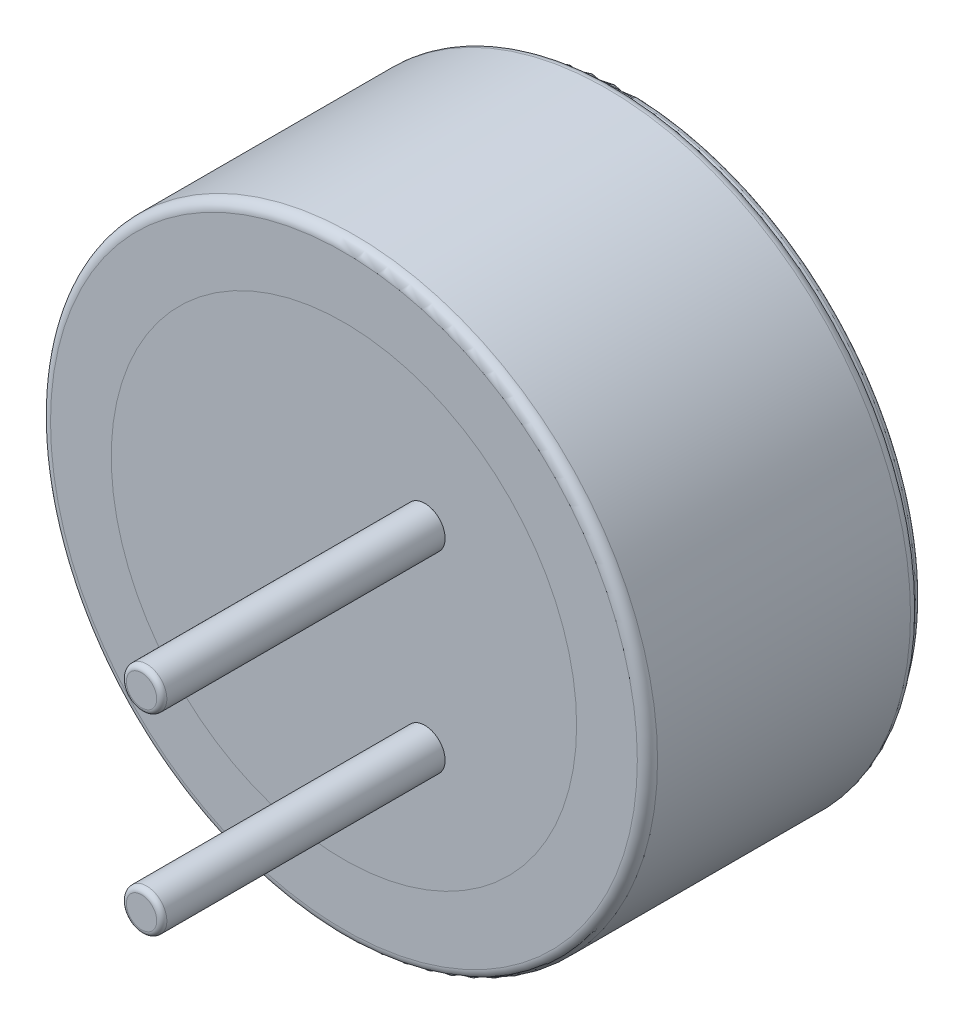
ISO-10303-21;
HEADER;
FILE_DESCRIPTION(('STEP AP214'),'2;1');
FILE_NAME('part.step','',(''),(''),'','','');
FILE_SCHEMA(('AUTOMOTIVE_DESIGN { 1 0 10303 214 1 1 1 1 }'));
ENDSEC;
DATA;
#1=APPLICATION_CONTEXT('core data for automotive mechanical design processes');
#2=APPLICATION_PROTOCOL_DEFINITION('international standard','automotive_design',2000,#1);
#3=PRODUCT_CONTEXT('',#1,'mechanical');
#4=PRODUCT('Part','Part','',(#3));
#5=PRODUCT_RELATED_PRODUCT_CATEGORY('part','',(#4));
#6=PRODUCT_DEFINITION_FORMATION('','',#4);
#7=PRODUCT_DEFINITION_CONTEXT('part definition',#1,'design');
#8=PRODUCT_DEFINITION('design','',#6,#7);
#9=PRODUCT_DEFINITION_SHAPE('','',#8);
#10=(LENGTH_UNIT() NAMED_UNIT(*) SI_UNIT(.MILLI.,.METRE.));
#11=(NAMED_UNIT(*) PLANE_ANGLE_UNIT() SI_UNIT($,.RADIAN.));
#12=(NAMED_UNIT(*) SI_UNIT($,.STERADIAN.) SOLID_ANGLE_UNIT());
#13=UNCERTAINTY_MEASURE_WITH_UNIT(LENGTH_MEASURE(1.E-05),#10,'distance_accuracy_value','');
#14=(GEOMETRIC_REPRESENTATION_CONTEXT(3) GLOBAL_UNCERTAINTY_ASSIGNED_CONTEXT((#13)) GLOBAL_UNIT_ASSIGNED_CONTEXT((#10,
#11,#12)) REPRESENTATION_CONTEXT('',''));
#15=CARTESIAN_POINT('',(0.,0.,0.));
#16=DIRECTION('',(0.,0.,1.));
#17=DIRECTION('',(1.,0.,0.));
#18=AXIS2_PLACEMENT_3D('',#15,#16,#17);
#19=CARTESIAN_POINT('',(0.,0.,2.7));
#20=DIRECTION('',(0.,0.,-1.));
#21=DIRECTION('',(-1.,0.,0.));
#22=AXIS2_PLACEMENT_3D('',#19,#20,#21);
#23=CYLINDRICAL_SURFACE('',#22,2.3);
#24=CARTESIAN_POINT('',(0.,0.,2.7));
#25=DIRECTION('',(0.,0.,1.));
#26=DIRECTION('',(1.,0.,0.));
#27=AXIS2_PLACEMENT_3D('',#24,#25,#26);
#28=CIRCLE('',#27,2.3);
#29=CARTESIAN_POINT('',(2.3,0.,2.7));
#30=VERTEX_POINT('',#29);
#31=EDGE_CURVE('E11',#30,#30,#28,.T.);
#32=ORIENTED_EDGE('',*,*,#31,.F.);
#33=EDGE_LOOP('',(#32));
#34=FACE_BOUND('',#33,.T.);
#35=CARTESIAN_POINT('',(0.,0.,2.6));
#36=DIRECTION('',(0.,0.,1.));
#37=DIRECTION('',(1.,0.,0.));
#38=AXIS2_PLACEMENT_3D('',#35,#36,#37);
#39=CIRCLE('',#38,2.3);
#40=CARTESIAN_POINT('',(2.3,0.,2.6));
#41=VERTEX_POINT('',#40);
#42=EDGE_CURVE('E45',#41,#41,#39,.T.);
#43=ORIENTED_EDGE('',*,*,#42,.T.);
#44=EDGE_LOOP('',(#43));
#45=FACE_BOUND('',#44,.T.);
#46=ADVANCED_FACE('F42',(#34,#45),#23,.T.);
#47=CARTESIAN_POINT('',(0.,0.,2.7));
#48=DIRECTION('',(0.,0.,1.));
#49=DIRECTION('',(1.,0.,0.));
#50=AXIS2_PLACEMENT_3D('',#47,#48,#49);
#51=PLANE('',#50);
#52=ORIENTED_EDGE('',*,*,#31,.T.);
#53=EDGE_LOOP('',(#52));
#54=FACE_BOUND('',#53,.T.);
#55=ADVANCED_FACE('F57',(#54),#51,.T.);
#56=CARTESIAN_POINT('',(0.,0.,2.6));
#57=DIRECTION('',(0.,0.,1.));
#58=DIRECTION('',(1.,0.,0.));
#59=AXIS2_PLACEMENT_3D('',#56,#57,#58);
#60=PLANE('',#59);
#61=ORIENTED_EDGE('',*,*,#42,.F.);
#62=EDGE_LOOP('',(#61));
#63=FACE_BOUND('',#62,.T.);
#64=ADVANCED_FACE('F55',(#63),#60,.F.);
#65=CLOSED_SHELL('',(#46,#55,#64));
#66=MANIFOLD_SOLID_BREP('B2',#65);
#67=CARTESIAN_POINT('',(0.,0.,-0.1));
#68=DIRECTION('',(0.,0.,1.));
#69=DIRECTION('',(1.,0.,0.));
#70=AXIS2_PLACEMENT_3D('',#67,#68,#69);
#71=CYLINDRICAL_SURFACE('',#70,2.9);
#72=CARTESIAN_POINT('',(0.,0.,-0.05));
#73=DIRECTION('',(0.,0.,-1.));
#74=DIRECTION('',(-1.,0.,0.));
#75=AXIS2_PLACEMENT_3D('',#72,#73,#74);
#76=CIRCLE('',#75,2.9);
#77=CARTESIAN_POINT('',(-2.9,0.,-0.05));
#78=VERTEX_POINT('',#77);
#79=EDGE_CURVE('E41',#78,#78,#76,.F.);
#80=ORIENTED_EDGE('',*,*,#79,.T.);
#81=EDGE_LOOP('',(#80));
#82=FACE_BOUND('',#81,.T.);
#83=CARTESIAN_POINT('',(0.,0.,0.));
#84=DIRECTION('',(0.,0.,-1.));
#85=DIRECTION('',(-1.,0.,0.));
#86=AXIS2_PLACEMENT_3D('',#83,#84,#85);
#87=CIRCLE('',#86,2.9);
#88=CARTESIAN_POINT('',(-2.9,0.,0.));
#89=VERTEX_POINT('',#88);
#90=EDGE_CURVE('E102',#89,#89,#87,.T.);
#91=ORIENTED_EDGE('',*,*,#90,.T.);
#92=EDGE_LOOP('',(#91));
#93=FACE_BOUND('',#92,.T.);
#94=ADVANCED_FACE('F91',(#82,#93),#71,.T.);
#95=CARTESIAN_POINT('',(0.,0.,-0.1));
#96=DIRECTION('',(0.,0.,-1.));
#97=DIRECTION('',(-1.,0.,0.));
#98=AXIS2_PLACEMENT_3D('',#95,#96,#97);
#99=PLANE('',#98);
#100=CARTESIAN_POINT('',(0.,0.,-0.1));
#101=DIRECTION('',(0.,0.,-1.));
#102=DIRECTION('',(-1.,0.,0.));
#103=AXIS2_PLACEMENT_3D('',#100,#101,#102);
#104=CIRCLE('',#103,2.85);
#105=CARTESIAN_POINT('',(-2.85,0.,-0.1));
#106=VERTEX_POINT('',#105);
#107=EDGE_CURVE('E98',#106,#106,#104,.T.);
#108=ORIENTED_EDGE('',*,*,#107,.T.);
#109=EDGE_LOOP('',(#108));
#110=FACE_BOUND('',#109,.T.);
#111=ADVANCED_FACE('F112',(#110),#99,.T.);
#112=CARTESIAN_POINT('',(0.,0.,0.));
#113=DIRECTION('',(0.,0.,-1.));
#114=DIRECTION('',(-1.,0.,0.));
#115=AXIS2_PLACEMENT_3D('',#112,#113,#114);
#116=PLANE('',#115);
#117=ORIENTED_EDGE('',*,*,#90,.F.);
#118=EDGE_LOOP('',(#117));
#119=FACE_BOUND('',#118,.T.);
#120=ADVANCED_FACE('F110',(#119),#116,.F.);
#121=CARTESIAN_POINT('',(0.,0.,-0.05));
#122=DIRECTION('',(0.,0.,-1.));
#123=DIRECTION('',(-1.,0.,0.));
#124=AXIS2_PLACEMENT_3D('',#121,#122,#123);
#125=TOROIDAL_SURFACE('',#124,2.85,0.05);
#126=ORIENTED_EDGE('',*,*,#79,.F.);
#127=EDGE_LOOP('',(#126));
#128=FACE_BOUND('',#127,.T.);
#129=ORIENTED_EDGE('',*,*,#107,.F.);
#130=EDGE_LOOP('',(#129));
#131=FACE_BOUND('',#130,.T.);
#132=ADVANCED_FACE('F93',(#128,#131),#125,.T.);
#133=CLOSED_SHELL('',(#94,#111,#120,#132));
#134=MANIFOLD_SOLID_BREP('B6',#133);
#135=CARTESIAN_POINT('',(0.800000000000001,0.95,5.5));
#136=DIRECTION('',(0.,0.,-1.));
#137=DIRECTION('',(-1.,0.,0.));
#138=AXIS2_PLACEMENT_3D('',#135,#136,#137);
#139=CYLINDRICAL_SURFACE('',#138,0.2);
#140=CARTESIAN_POINT('',(0.800000000000001,0.95,5.45));
#141=DIRECTION('',(0.,0.,-1.));
#142=DIRECTION('',(-1.,0.,0.));
#143=AXIS2_PLACEMENT_3D('',#140,#141,#142);
#144=CIRCLE('',#143,0.2);
#145=CARTESIAN_POINT('',(0.600000000000001,0.95,5.45));
#146=VERTEX_POINT('',#145);
#147=EDGE_CURVE('E90',#146,#146,#144,.T.);
#148=ORIENTED_EDGE('',*,*,#147,.T.);
#149=EDGE_LOOP('',(#148));
#150=FACE_BOUND('',#149,.T.);
#151=CARTESIAN_POINT('',(0.800000000000001,0.95,2.7));
#152=DIRECTION('',(0.,0.,1.));
#153=DIRECTION('',(-1.,0.,0.));
#154=AXIS2_PLACEMENT_3D('',#151,#152,#153);
#155=CIRCLE('',#154,0.2);
#156=CARTESIAN_POINT('',(0.600000000000001,0.95,2.7));
#157=VERTEX_POINT('',#156);
#158=EDGE_CURVE('E166',#157,#157,#155,.T.);
#159=ORIENTED_EDGE('',*,*,#158,.T.);
#160=EDGE_LOOP('',(#159));
#161=FACE_BOUND('',#160,.T.);
#162=ADVANCED_FACE('F155',(#150,#161),#139,.T.);
#163=CARTESIAN_POINT('',(0.800000000000001,0.95,5.5));
#164=DIRECTION('',(0.,0.,-1.));
#165=DIRECTION('',(-1.,0.,0.));
#166=AXIS2_PLACEMENT_3D('',#163,#164,#165);
#167=PLANE('',#166);
#168=CARTESIAN_POINT('',(0.800000000000001,0.95,5.5));
#169=DIRECTION('',(0.,0.,-1.));
#170=DIRECTION('',(-1.,0.,0.));
#171=AXIS2_PLACEMENT_3D('',#168,#169,#170);
#172=CIRCLE('',#171,0.15);
#173=CARTESIAN_POINT('',(0.650000000000001,0.95,5.5));
#174=VERTEX_POINT('',#173);
#175=EDGE_CURVE('E162',#174,#174,#172,.F.);
#176=ORIENTED_EDGE('',*,*,#175,.T.);
#177=EDGE_LOOP('',(#176));
#178=FACE_BOUND('',#177,.T.);
#179=ADVANCED_FACE('F176',(#178),#167,.F.);
#180=CARTESIAN_POINT('',(0.800000000000001,0.95,2.7));
#181=DIRECTION('',(0.,0.,-1.));
#182=DIRECTION('',(-1.,0.,0.));
#183=AXIS2_PLACEMENT_3D('',#180,#181,#182);
#184=PLANE('',#183);
#185=ORIENTED_EDGE('',*,*,#158,.F.);
#186=EDGE_LOOP('',(#185));
#187=FACE_BOUND('',#186,.T.);
#188=ADVANCED_FACE('F174',(#187),#184,.T.);
#189=CARTESIAN_POINT('',(0.800000000000001,0.95,5.45));
#190=DIRECTION('',(0.,0.,-1.));
#191=DIRECTION('',(-1.,0.,0.));
#192=AXIS2_PLACEMENT_3D('',#189,#190,#191);
#193=TOROIDAL_SURFACE('',#192,0.15,0.05);
#194=ORIENTED_EDGE('',*,*,#147,.F.);
#195=EDGE_LOOP('',(#194));
#196=FACE_BOUND('',#195,.T.);
#197=ORIENTED_EDGE('',*,*,#175,.F.);
#198=EDGE_LOOP('',(#197));
#199=FACE_BOUND('',#198,.T.);
#200=ADVANCED_FACE('F157',(#196,#199),#193,.T.);
#201=CLOSED_SHELL('',(#162,#179,#188,#200));
#202=MANIFOLD_SOLID_BREP('B36',#201);
#203=CARTESIAN_POINT('',(0.800000000000001,-0.95,5.5));
#204=DIRECTION('',(0.,0.,-1.));
#205=DIRECTION('',(-1.,0.,0.));
#206=AXIS2_PLACEMENT_3D('',#203,#204,#205);
#207=CYLINDRICAL_SURFACE('',#206,0.2);
#208=CARTESIAN_POINT('',(0.800000000000001,-0.95,5.45));
#209=DIRECTION('',(0.,0.,1.));
#210=DIRECTION('',(1.,0.,0.));
#211=AXIS2_PLACEMENT_3D('',#208,#209,#210);
#212=CIRCLE('',#211,0.2);
#213=CARTESIAN_POINT('',(1.,-0.95,5.45));
#214=VERTEX_POINT('',#213);
#215=EDGE_CURVE('E154',#214,#214,#212,.F.);
#216=ORIENTED_EDGE('',*,*,#215,.T.);
#217=EDGE_LOOP('',(#216));
#218=FACE_BOUND('',#217,.T.);
#219=CARTESIAN_POINT('',(0.800000000000001,-0.95,2.7));
#220=DIRECTION('',(0.,0.,1.));
#221=DIRECTION('',(1.,0.,0.));
#222=AXIS2_PLACEMENT_3D('',#219,#220,#221);
#223=CIRCLE('',#222,0.2);
#224=CARTESIAN_POINT('',(1.,-0.95,2.7));
#225=VERTEX_POINT('',#224);
#226=EDGE_CURVE('E229',#225,#225,#223,.T.);
#227=ORIENTED_EDGE('',*,*,#226,.T.);
#228=EDGE_LOOP('',(#227));
#229=FACE_BOUND('',#228,.T.);
#230=ADVANCED_FACE('F218',(#218,#229),#207,.T.);
#231=CARTESIAN_POINT('',(0.800000000000001,-0.95,5.5));
#232=DIRECTION('',(0.,0.,1.));
#233=DIRECTION('',(1.,0.,0.));
#234=AXIS2_PLACEMENT_3D('',#231,#232,#233);
#235=PLANE('',#234);
#236=CARTESIAN_POINT('',(0.800000000000001,-0.95,5.5));
#237=DIRECTION('',(0.,0.,1.));
#238=DIRECTION('',(1.,0.,0.));
#239=AXIS2_PLACEMENT_3D('',#236,#237,#238);
#240=CIRCLE('',#239,0.15);
#241=CARTESIAN_POINT('',(0.950000000000001,-0.95,5.5));
#242=VERTEX_POINT('',#241);
#243=EDGE_CURVE('E225',#242,#242,#240,.T.);
#244=ORIENTED_EDGE('',*,*,#243,.T.);
#245=EDGE_LOOP('',(#244));
#246=FACE_BOUND('',#245,.T.);
#247=ADVANCED_FACE('F239',(#246),#235,.T.);
#248=CARTESIAN_POINT('',(0.800000000000001,-0.95,2.7));
#249=DIRECTION('',(0.,0.,1.));
#250=DIRECTION('',(1.,0.,0.));
#251=AXIS2_PLACEMENT_3D('',#248,#249,#250);
#252=PLANE('',#251);
#253=ORIENTED_EDGE('',*,*,#226,.F.);
#254=EDGE_LOOP('',(#253));
#255=FACE_BOUND('',#254,.T.);
#256=ADVANCED_FACE('F237',(#255),#252,.F.);
#257=CARTESIAN_POINT('',(0.800000000000001,-0.95,5.45));
#258=DIRECTION('',(0.,0.,1.));
#259=DIRECTION('',(1.,0.,0.));
#260=AXIS2_PLACEMENT_3D('',#257,#258,#259);
#261=TOROIDAL_SURFACE('',#260,0.15,0.05);
#262=ORIENTED_EDGE('',*,*,#215,.F.);
#263=EDGE_LOOP('',(#262));
#264=FACE_BOUND('',#263,.T.);
#265=ORIENTED_EDGE('',*,*,#243,.F.);
#266=EDGE_LOOP('',(#265));
#267=FACE_BOUND('',#266,.T.);
#268=ADVANCED_FACE('F220',(#264,#267),#261,.T.);
#269=CLOSED_SHELL('',(#230,#247,#256,#268));
#270=MANIFOLD_SOLID_BREP('B85',#269);
#271=CARTESIAN_POINT('',(0.,0.,2.7));
#272=DIRECTION('',(0.,0.,-1.));
#273=DIRECTION('',(-1.,0.,0.));
#274=AXIS2_PLACEMENT_3D('',#271,#272,#273);
#275=CYLINDRICAL_SURFACE('',#274,3.);
#276=CARTESIAN_POINT('',(0.,0.,2.6));
#277=DIRECTION('',(0.,0.,1.));
#278=DIRECTION('',(1.,0.,0.));
#279=AXIS2_PLACEMENT_3D('',#276,#277,#278);
#280=CIRCLE('',#279,3.);
#281=CARTESIAN_POINT('',(3.,0.,2.6));
#282=VERTEX_POINT('',#281);
#283=EDGE_CURVE('E281',#282,#282,#280,.F.);
#284=ORIENTED_EDGE('',*,*,#283,.T.);
#285=EDGE_LOOP('',(#284));
#286=FACE_BOUND('',#285,.T.);
#287=CARTESIAN_POINT('',(0.,0.,0.0999999999999998));
#288=DIRECTION('',(0.,0.,1.));
#289=DIRECTION('',(1.,0.,0.));
#290=AXIS2_PLACEMENT_3D('',#287,#288,#289);
#291=CIRCLE('',#290,3.);
#292=CARTESIAN_POINT('',(3.,0.,0.0999999999999998));
#293=VERTEX_POINT('',#292);
#294=EDGE_CURVE('E285',#293,#293,#291,.T.);
#295=ORIENTED_EDGE('',*,*,#294,.T.);
#296=EDGE_LOOP('',(#295));
#297=FACE_BOUND('',#296,.T.);
#298=ADVANCED_FACE('F274',(#286,#297),#275,.T.);
#299=CARTESIAN_POINT('',(0.,0.,2.7));
#300=DIRECTION('',(0.,0.,1.));
#301=DIRECTION('',(1.,0.,0.));
#302=AXIS2_PLACEMENT_3D('',#299,#300,#301);
#303=PLANE('',#302);
#304=CARTESIAN_POINT('',(0.,0.,2.7));
#305=DIRECTION('',(0.,0.,1.));
#306=DIRECTION('',(1.,0.,0.));
#307=AXIS2_PLACEMENT_3D('',#304,#305,#306);
#308=CIRCLE('',#307,2.3);
#309=CARTESIAN_POINT('',(2.3,0.,2.7));
#310=VERTEX_POINT('',#309);
#311=EDGE_CURVE('E295',#310,#310,#308,.T.);
#312=ORIENTED_EDGE('',*,*,#311,.F.);
#313=EDGE_LOOP('',(#312));
#314=FACE_BOUND('',#313,.T.);
#315=CARTESIAN_POINT('',(0.,0.,2.7));
#316=DIRECTION('',(0.,0.,1.));
#317=DIRECTION('',(1.,0.,0.));
#318=AXIS2_PLACEMENT_3D('',#315,#316,#317);
#319=CIRCLE('',#318,2.9);
#320=CARTESIAN_POINT('',(2.9,0.,2.7));
#321=VERTEX_POINT('',#320);
#322=EDGE_CURVE('E289',#321,#321,#319,.T.);
#323=ORIENTED_EDGE('',*,*,#322,.T.);
#324=EDGE_LOOP('',(#323));
#325=FACE_BOUND('',#324,.T.);
#326=ADVANCED_FACE('F309',(#314,#325),#303,.T.);
#327=CARTESIAN_POINT('',(0.,0.,0.));
#328=DIRECTION('',(0.,0.,1.));
#329=DIRECTION('',(1.,0.,0.));
#330=AXIS2_PLACEMENT_3D('',#327,#328,#329);
#331=PLANE('',#330);
#332=CARTESIAN_POINT('',(0.,0.,0.));
#333=DIRECTION('',(0.,0.,1.));
#334=DIRECTION('',(1.,0.,0.));
#335=AXIS2_PLACEMENT_3D('',#332,#333,#334);
#336=CIRCLE('',#335,2.9);
#337=CARTESIAN_POINT('',(2.9,0.,0.));
#338=VERTEX_POINT('',#337);
#339=EDGE_CURVE('E217',#338,#338,#336,.F.);
#340=ORIENTED_EDGE('',*,*,#339,.T.);
#341=EDGE_LOOP('',(#340));
#342=FACE_BOUND('',#341,.T.);
#343=ADVANCED_FACE('F312',(#342),#331,.F.);
#344=CARTESIAN_POINT('',(0.,0.,2.6));
#345=DIRECTION('',(0.,0.,1.));
#346=DIRECTION('',(1.,0.,0.));
#347=AXIS2_PLACEMENT_3D('',#344,#345,#346);
#348=TOROIDAL_SURFACE('',#347,2.9,0.1);
#349=ORIENTED_EDGE('',*,*,#283,.F.);
#350=EDGE_LOOP('',(#349));
#351=FACE_BOUND('',#350,.T.);
#352=ORIENTED_EDGE('',*,*,#322,.F.);
#353=EDGE_LOOP('',(#352));
#354=FACE_BOUND('',#353,.T.);
#355=ADVANCED_FACE('F316',(#351,#354),#348,.T.);
#356=CARTESIAN_POINT('',(0.,0.,0.0999999999999998));
#357=DIRECTION('',(0.,0.,1.));
#358=DIRECTION('',(1.,0.,0.));
#359=AXIS2_PLACEMENT_3D('',#356,#357,#358);
#360=TOROIDAL_SURFACE('',#359,2.9,0.1);
#361=ORIENTED_EDGE('',*,*,#339,.F.);
#362=EDGE_LOOP('',(#361));
#363=FACE_BOUND('',#362,.T.);
#364=ORIENTED_EDGE('',*,*,#294,.F.);
#365=EDGE_LOOP('',(#364));
#366=FACE_BOUND('',#365,.T.);
#367=ADVANCED_FACE('F276',(#363,#366),#360,.T.);
#368=CARTESIAN_POINT('',(0.,0.,2.6));
#369=DIRECTION('',(0.,0.,1.));
#370=DIRECTION('',(1.,0.,0.));
#371=AXIS2_PLACEMENT_3D('',#368,#369,#370);
#372=CYLINDRICAL_SURFACE('',#371,2.3);
#373=CARTESIAN_POINT('',(0.,0.,2.6));
#374=DIRECTION('',(0.,0.,1.));
#375=DIRECTION('',(1.,0.,0.));
#376=AXIS2_PLACEMENT_3D('',#373,#374,#375);
#377=CIRCLE('',#376,2.3);
#378=CARTESIAN_POINT('',(2.3,0.,2.6));
#379=VERTEX_POINT('',#378);
#380=EDGE_CURVE('E294',#379,#379,#377,.T.);
#381=ORIENTED_EDGE('',*,*,#380,.F.);
#382=EDGE_LOOP('',(#381));
#383=FACE_BOUND('',#382,.T.);
#384=ORIENTED_EDGE('',*,*,#311,.T.);
#385=EDGE_LOOP('',(#384));
#386=FACE_BOUND('',#385,.T.);
#387=ADVANCED_FACE('F303',(#383,#386),#372,.F.);
#388=CARTESIAN_POINT('',(0.,0.,2.6));
#389=DIRECTION('',(0.,0.,1.));
#390=DIRECTION('',(1.,0.,0.));
#391=AXIS2_PLACEMENT_3D('',#388,#389,#390);
#392=PLANE('',#391);
#393=ORIENTED_EDGE('',*,*,#380,.T.);
#394=EDGE_LOOP('',(#393));
#395=FACE_BOUND('',#394,.T.);
#396=ADVANCED_FACE('F301',(#395),#392,.T.);
#397=CLOSED_SHELL('',(#298,#326,#343,#355,#367,#387,#396));
#398=MANIFOLD_SOLID_BREP('B149',#397);
#399=ADVANCED_BREP_SHAPE_REPRESENTATION('',(#18,#66,#134,#202,#270,#398),#14);
#400=SHAPE_DEFINITION_REPRESENTATION(#9,#399);
ENDSEC;
END-ISO-10303-21;
